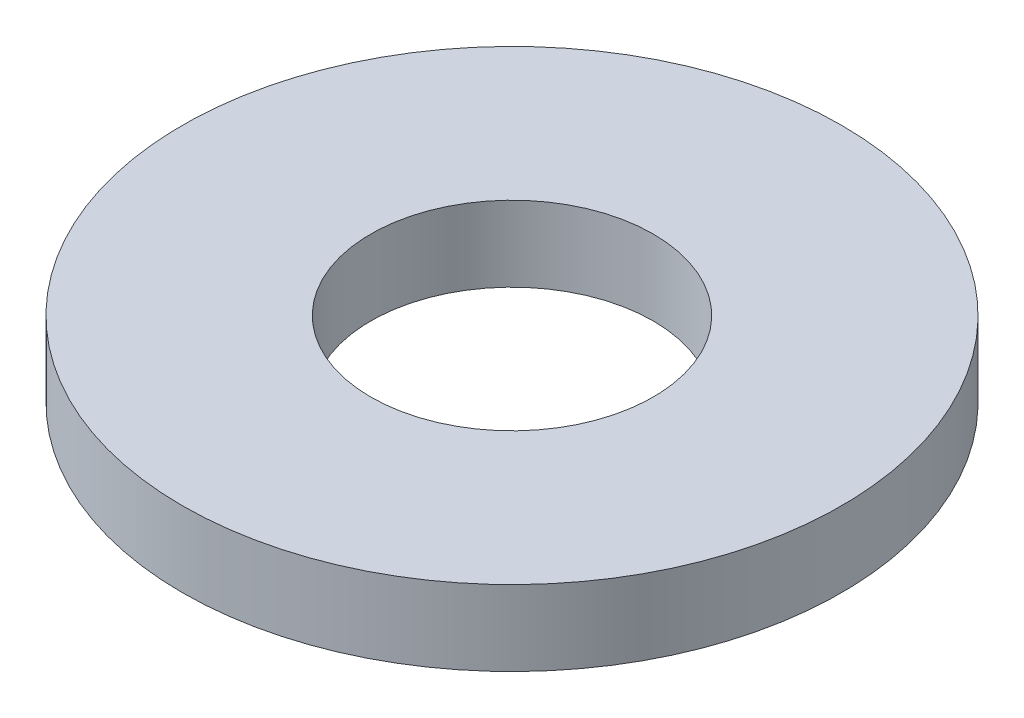
ISO-10303-21;
HEADER;
FILE_DESCRIPTION(('STEP AP214'),'2;1');
FILE_NAME('part.step','',(''),(''),'','','');
FILE_SCHEMA(('AUTOMOTIVE_DESIGN { 1 0 10303 214 1 1 1 1 }'));
ENDSEC;
DATA;
#1=APPLICATION_CONTEXT('core data for automotive mechanical design processes');
#2=APPLICATION_PROTOCOL_DEFINITION('international standard','automotive_design',2000,#1);
#3=PRODUCT_CONTEXT('',#1,'mechanical');
#4=PRODUCT('Part','Part','',(#3));
#5=PRODUCT_RELATED_PRODUCT_CATEGORY('part','',(#4));
#6=PRODUCT_DEFINITION_FORMATION('','',#4);
#7=PRODUCT_DEFINITION_CONTEXT('part definition',#1,'design');
#8=PRODUCT_DEFINITION('design','',#6,#7);
#9=PRODUCT_DEFINITION_SHAPE('','',#8);
#10=(LENGTH_UNIT() NAMED_UNIT(*) SI_UNIT(.MILLI.,.METRE.));
#11=(NAMED_UNIT(*) PLANE_ANGLE_UNIT() SI_UNIT($,.RADIAN.));
#12=(NAMED_UNIT(*) SI_UNIT($,.STERADIAN.) SOLID_ANGLE_UNIT());
#13=UNCERTAINTY_MEASURE_WITH_UNIT(LENGTH_MEASURE(1.E-05),#10,'distance_accuracy_value','');
#14=(GEOMETRIC_REPRESENTATION_CONTEXT(3) GLOBAL_UNCERTAINTY_ASSIGNED_CONTEXT((#13)) GLOBAL_UNIT_ASSIGNED_CONTEXT((#10,
#11,#12)) REPRESENTATION_CONTEXT('',''));
#15=CARTESIAN_POINT('',(0.,0.,0.));
#16=DIRECTION('',(0.,0.,1.));
#17=DIRECTION('',(1.,0.,0.));
#18=AXIS2_PLACEMENT_3D('',#15,#16,#17);
#19=CARTESIAN_POINT('',(0.,16.,0.));
#20=DIRECTION('',(0.,-1.,0.));
#21=DIRECTION('',(0.,0.,-1.));
#22=AXIS2_PLACEMENT_3D('',#19,#20,#21);
#23=CYLINDRICAL_SURFACE('',#22,70.);
#24=CARTESIAN_POINT('',(0.,16.,0.));
#25=DIRECTION('',(0.,1.,0.));
#26=DIRECTION('',(0.,0.,1.));
#27=AXIS2_PLACEMENT_3D('',#24,#25,#26);
#28=CIRCLE('',#27,70.);
#29=CARTESIAN_POINT('',(0.,16.,70.));
#30=VERTEX_POINT('',#29);
#31=EDGE_CURVE('E10',#30,#30,#28,.T.);
#32=ORIENTED_EDGE('',*,*,#31,.F.);
#33=EDGE_LOOP('',(#32));
#34=FACE_BOUND('',#33,.T.);
#35=CARTESIAN_POINT('',(0.,0.,0.));
#36=DIRECTION('',(0.,1.,0.));
#37=DIRECTION('',(0.,0.,1.));
#38=AXIS2_PLACEMENT_3D('',#35,#36,#37);
#39=CIRCLE('',#38,70.);
#40=CARTESIAN_POINT('',(0.,0.,70.));
#41=VERTEX_POINT('',#40);
#42=EDGE_CURVE('E37',#41,#41,#39,.T.);
#43=ORIENTED_EDGE('',*,*,#42,.T.);
#44=EDGE_LOOP('',(#43));
#45=FACE_BOUND('',#44,.T.);
#46=ADVANCED_FACE('F40',(#34,#45),#23,.T.);
#47=CARTESIAN_POINT('',(0.,16.,0.));
#48=DIRECTION('',(0.,1.,0.));
#49=DIRECTION('',(0.,0.,1.));
#50=AXIS2_PLACEMENT_3D('',#47,#48,#49);
#51=PLANE('',#50);
#52=CARTESIAN_POINT('',(0.,16.,0.));
#53=DIRECTION('',(0.,1.,0.));
#54=DIRECTION('',(0.,0.,1.));
#55=AXIS2_PLACEMENT_3D('',#52,#53,#54);
#56=CIRCLE('',#55,30.);
#57=CARTESIAN_POINT('',(0.,16.,30.));
#58=VERTEX_POINT('',#57);
#59=EDGE_CURVE('E50',#58,#58,#56,.T.);
#60=ORIENTED_EDGE('',*,*,#59,.F.);
#61=EDGE_LOOP('',(#60));
#62=FACE_BOUND('',#61,.T.);
#63=ORIENTED_EDGE('',*,*,#31,.T.);
#64=EDGE_LOOP('',(#63));
#65=FACE_BOUND('',#64,.T.);
#66=ADVANCED_FACE('F59',(#62,#65),#51,.T.);
#67=CARTESIAN_POINT('',(0.,0.,0.));
#68=DIRECTION('',(0.,1.,0.));
#69=DIRECTION('',(0.,0.,1.));
#70=AXIS2_PLACEMENT_3D('',#67,#68,#69);
#71=PLANE('',#70);
#72=CARTESIAN_POINT('',(0.,0.,0.));
#73=DIRECTION('',(0.,1.,0.));
#74=DIRECTION('',(0.,0.,1.));
#75=AXIS2_PLACEMENT_3D('',#72,#73,#74);
#76=CIRCLE('',#75,30.);
#77=CARTESIAN_POINT('',(0.,0.,30.));
#78=VERTEX_POINT('',#77);
#79=EDGE_CURVE('E47',#78,#78,#76,.T.);
#80=ORIENTED_EDGE('',*,*,#79,.T.);
#81=EDGE_LOOP('',(#80));
#82=FACE_BOUND('',#81,.T.);
#83=ORIENTED_EDGE('',*,*,#42,.F.);
#84=EDGE_LOOP('',(#83));
#85=FACE_BOUND('',#84,.T.);
#86=ADVANCED_FACE('F58',(#82,#85),#71,.F.);
#87=CARTESIAN_POINT('',(0.,16.,0.));
#88=DIRECTION('',(0.,-1.,0.));
#89=DIRECTION('',(0.,0.,-1.));
#90=AXIS2_PLACEMENT_3D('',#87,#88,#89);
#91=CYLINDRICAL_SURFACE('',#90,30.);
#92=ORIENTED_EDGE('',*,*,#59,.T.);
#93=EDGE_LOOP('',(#92));
#94=FACE_BOUND('',#93,.T.);
#95=ORIENTED_EDGE('',*,*,#79,.F.);
#96=EDGE_LOOP('',(#95));
#97=FACE_BOUND('',#96,.T.);
#98=ADVANCED_FACE('F54',(#94,#97),#91,.F.);
#99=CLOSED_SHELL('',(#46,#66,#86,#98));
#100=MANIFOLD_SOLID_BREP('B2',#99);
#101=ADVANCED_BREP_SHAPE_REPRESENTATION('',(#18,#100),#14);
#102=SHAPE_DEFINITION_REPRESENTATION(#9,#101);
ENDSEC;
END-ISO-10303-21;
